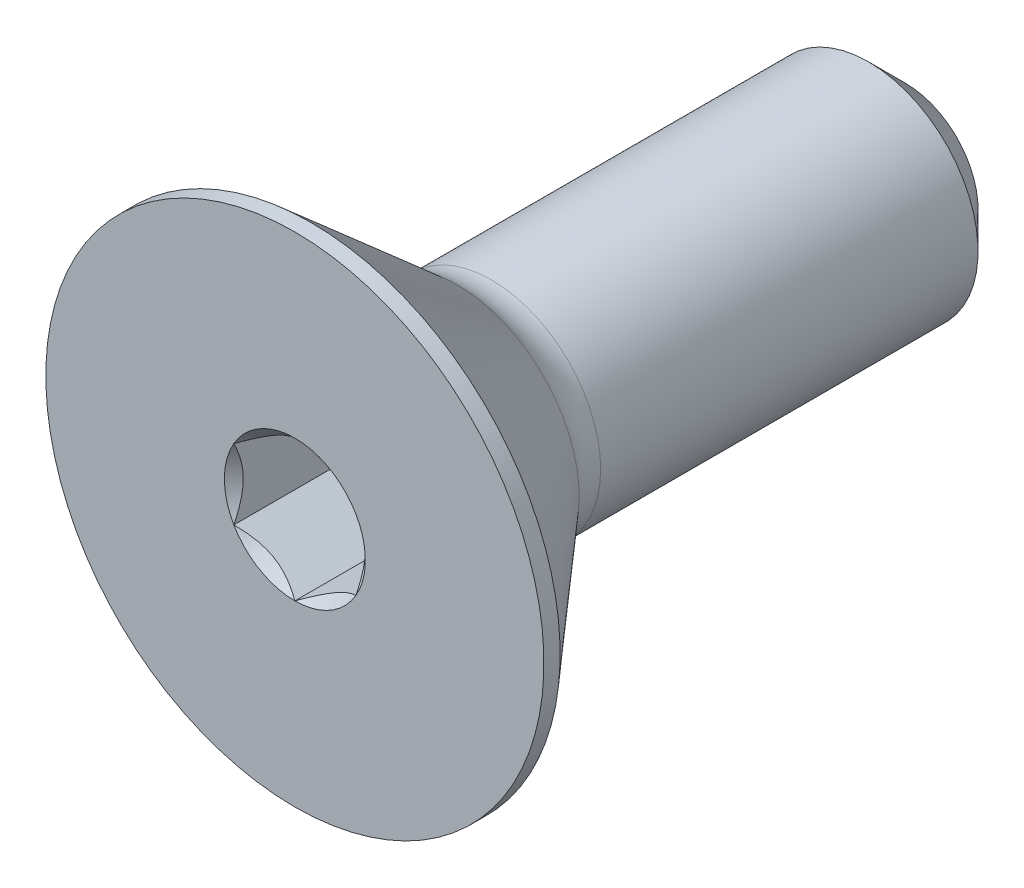
ISO-10303-21;
HEADER;
FILE_DESCRIPTION(('STEP AP214'),'2;1');
FILE_NAME('part.step','',(''),(''),'','','');
FILE_SCHEMA(('AUTOMOTIVE_DESIGN { 1 0 10303 214 1 1 1 1 }'));
ENDSEC;
DATA;
#1=APPLICATION_CONTEXT('core data for automotive mechanical design processes');
#2=APPLICATION_PROTOCOL_DEFINITION('international standard','automotive_design',2000,#1);
#3=PRODUCT_CONTEXT('',#1,'mechanical');
#4=PRODUCT('Part','Part','',(#3));
#5=PRODUCT_RELATED_PRODUCT_CATEGORY('part','',(#4));
#6=PRODUCT_DEFINITION_FORMATION('','',#4);
#7=PRODUCT_DEFINITION_CONTEXT('part definition',#1,'design');
#8=PRODUCT_DEFINITION('design','',#6,#7);
#9=PRODUCT_DEFINITION_SHAPE('','',#8);
#10=(LENGTH_UNIT() NAMED_UNIT(*) SI_UNIT(.MILLI.,.METRE.));
#11=(NAMED_UNIT(*) PLANE_ANGLE_UNIT() SI_UNIT($,.RADIAN.));
#12=(NAMED_UNIT(*) SI_UNIT($,.STERADIAN.) SOLID_ANGLE_UNIT());
#13=UNCERTAINTY_MEASURE_WITH_UNIT(LENGTH_MEASURE(1.E-05),#10,'distance_accuracy_value','');
#14=(GEOMETRIC_REPRESENTATION_CONTEXT(3) GLOBAL_UNCERTAINTY_ASSIGNED_CONTEXT((#13)) GLOBAL_UNIT_ASSIGNED_CONTEXT((#10,
#11,#12)) REPRESENTATION_CONTEXT('',''));
#15=CARTESIAN_POINT('',(0.,0.,0.));
#16=DIRECTION('',(0.,0.,1.));
#17=DIRECTION('',(1.,0.,0.));
#18=AXIS2_PLACEMENT_3D('',#15,#16,#17);
#19=CARTESIAN_POINT('',(0.,0.,0.));
#20=DIRECTION('',(0.,0.,-1.));
#21=DIRECTION('',(0.,1.,0.));
#22=AXIS2_PLACEMENT_3D('',#19,#20,#21);
#23=PLANE('',#22);
#24=CARTESIAN_POINT('',(0.,0.,0.));
#25=DIRECTION('',(0.,0.,1.));
#26=DIRECTION('',(1.,0.,0.));
#27=AXIS2_PLACEMENT_3D('',#24,#25,#26);
#28=CIRCLE('',#27,0.916543552338531);
#29=CARTESIAN_POINT('',(0.,0.916543552338531,0.));
#30=VERTEX_POINT('',#29);
#31=CARTESIAN_POINT('',(-0.79375,0.458271776169266,0.));
#32=VERTEX_POINT('',#31);
#33=EDGE_CURVE('E135',#30,#32,#28,.T.);
#34=ORIENTED_EDGE('',*,*,#33,.F.);
#35=CARTESIAN_POINT('',(0.793749999999999,0.458271776169267,0.));
#36=VERTEX_POINT('',#35);
#37=EDGE_CURVE('E132',#36,#30,#28,.T.);
#38=ORIENTED_EDGE('',*,*,#37,.F.);
#39=CARTESIAN_POINT('',(0.79375,-0.458271776169267,0.));
#40=VERTEX_POINT('',#39);
#41=EDGE_CURVE('E103',#40,#36,#28,.T.);
#42=ORIENTED_EDGE('',*,*,#41,.F.);
#43=CARTESIAN_POINT('',(0.,-0.916543552338531,0.));
#44=VERTEX_POINT('',#43);
#45=EDGE_CURVE('E95',#44,#40,#28,.T.);
#46=ORIENTED_EDGE('',*,*,#45,.F.);
#47=CARTESIAN_POINT('',(-0.79375,-0.458271776169265,0.));
#48=VERTEX_POINT('',#47);
#49=EDGE_CURVE('E56',#48,#44,#28,.T.);
#50=ORIENTED_EDGE('',*,*,#49,.F.);
#51=EDGE_CURVE('E63',#32,#48,#28,.T.);
#52=ORIENTED_EDGE('',*,*,#51,.F.);
#53=EDGE_LOOP('',(#34,#38,#42,#46,#50,#52));
#54=FACE_BOUND('',#53,.T.);
#55=CARTESIAN_POINT('',(0.,0.,0.));
#56=DIRECTION('',(0.,0.,1.));
#57=DIRECTION('',(0.,-1.,0.));
#58=AXIS2_PLACEMENT_3D('',#55,#56,#57);
#59=CIRCLE('',#58,3.2385);
#60=CARTESIAN_POINT('',(0.,-3.2385,0.));
#61=VERTEX_POINT('',#60);
#62=EDGE_CURVE('E177',#61,#61,#59,.T.);
#63=ORIENTED_EDGE('',*,*,#62,.T.);
#64=EDGE_LOOP('',(#63));
#65=FACE_BOUND('',#64,.T.);
#66=ADVANCED_FACE('F37',(#54,#65),#23,.F.);
#67=CARTESIAN_POINT('',(0.,0.,-2.55414694180031));
#68=DIRECTION('',(0.,0.,1.));
#69=DIRECTION('',(0.,-1.,0.));
#70=AXIS2_PLACEMENT_3D('',#67,#68,#69);
#71=TOROIDAL_SURFACE('',#70,2.10213600254615,0.679736002546144);
#72=CARTESIAN_POINT('',(0.,0.,-2.1082));
#73=DIRECTION('',(0.,0.,1.));
#74=DIRECTION('',(0.,-1.,0.));
#75=AXIS2_PLACEMENT_3D('',#72,#73,#74);
#76=CIRCLE('',#75,1.58913272940224);
#77=CARTESIAN_POINT('',(0.,-1.58913272940224,-2.1082));
#78=VERTEX_POINT('',#77);
#79=EDGE_CURVE('E50',#78,#78,#76,.T.);
#80=ORIENTED_EDGE('',*,*,#79,.F.);
#81=EDGE_LOOP('',(#80));
#82=FACE_BOUND('',#81,.T.);
#83=CARTESIAN_POINT('',(0.,0.,-2.55414694180031));
#84=DIRECTION('',(0.,0.,1.));
#85=DIRECTION('',(1.,0.,0.));
#86=AXIS2_PLACEMENT_3D('',#83,#84,#85);
#87=CIRCLE('',#86,1.4224);
#88=CARTESIAN_POINT('',(1.4224,0.,-2.55414694180031));
#89=VERTEX_POINT('',#88);
#90=EDGE_CURVE('E174',#89,#89,#87,.F.);
#91=ORIENTED_EDGE('',*,*,#90,.F.);
#92=EDGE_LOOP('',(#91));
#93=FACE_BOUND('',#92,.T.);
#94=ADVANCED_FACE('F187',(#82,#93),#71,.F.);
#95=CARTESIAN_POINT('',(0.,0.,-2.1082));
#96=DIRECTION('',(0.,0.,1.));
#97=DIRECTION('',(0.,-1.,0.));
#98=AXIS2_PLACEMENT_3D('',#95,#96,#97);
#99=CONICAL_SURFACE('',#98,1.58913272940224,0.715584993317676);
#100=CARTESIAN_POINT('',(0.,0.,-0.210819999999999));
#101=DIRECTION('',(0.,0.,1.));
#102=DIRECTION('',(0.,-1.,0.));
#103=AXIS2_PLACEMENT_3D('',#100,#101,#102);
#104=CIRCLE('',#103,3.2385);
#105=CARTESIAN_POINT('',(0.,-3.2385,-0.210819999999998));
#106=VERTEX_POINT('',#105);
#107=EDGE_CURVE('E180',#106,#106,#104,.T.);
#108=ORIENTED_EDGE('',*,*,#107,.F.);
#109=EDGE_LOOP('',(#108));
#110=FACE_BOUND('',#109,.T.);
#111=ORIENTED_EDGE('',*,*,#79,.T.);
#112=EDGE_LOOP('',(#111));
#113=FACE_BOUND('',#112,.T.);
#114=ADVANCED_FACE('F185',(#110,#113),#99,.T.);
#115=CARTESIAN_POINT('',(0.,0.,0.));
#116=DIRECTION('',(0.,0.,1.));
#117=DIRECTION('',(0.,-1.,0.));
#118=AXIS2_PLACEMENT_3D('',#115,#116,#117);
#119=CYLINDRICAL_SURFACE('',#118,3.2385);
#120=ORIENTED_EDGE('',*,*,#62,.F.);
#121=EDGE_LOOP('',(#120));
#122=FACE_BOUND('',#121,.T.);
#123=ORIENTED_EDGE('',*,*,#107,.T.);
#124=EDGE_LOOP('',(#123));
#125=FACE_BOUND('',#124,.T.);
#126=ADVANCED_FACE('F206',(#122,#125),#119,.T.);
#127=CARTESIAN_POINT('',(0.,-1.4224,-7.9375));
#128=DIRECTION('',(0.,0.,-1.));
#129=DIRECTION('',(0.,1.,0.));
#130=AXIS2_PLACEMENT_3D('',#127,#128,#129);
#131=PLANE('',#130);
#132=CARTESIAN_POINT('',(0.,0.,-7.9375));
#133=DIRECTION('',(0.,0.,-1.));
#134=DIRECTION('',(0.,1.,0.));
#135=AXIS2_PLACEMENT_3D('',#132,#133,#134);
#136=CIRCLE('',#135,0.94615);
#137=CARTESIAN_POINT('',(0.,0.946149999999999,-7.9375));
#138=VERTEX_POINT('',#137);
#139=EDGE_CURVE('E168',#138,#138,#136,.T.);
#140=ORIENTED_EDGE('',*,*,#139,.T.);
#141=EDGE_LOOP('',(#140));
#142=FACE_BOUND('',#141,.T.);
#143=ADVANCED_FACE('F196',(#142),#131,.T.);
#144=CARTESIAN_POINT('',(0.,0.,-7.9375));
#145=DIRECTION('',(0.,0.,-1.));
#146=DIRECTION('',(0.,1.,0.));
#147=AXIS2_PLACEMENT_3D('',#144,#145,#146);
#148=CYLINDRICAL_SURFACE('',#147,1.4224);
#149=ORIENTED_EDGE('',*,*,#90,.T.);
#150=EDGE_LOOP('',(#149));
#151=FACE_BOUND('',#150,.T.);
#152=CARTESIAN_POINT('',(0.,0.,-7.46125));
#153=DIRECTION('',(0.,0.,-1.));
#154=DIRECTION('',(0.,1.,0.));
#155=AXIS2_PLACEMENT_3D('',#152,#153,#154);
#156=CIRCLE('',#155,1.4224);
#157=CARTESIAN_POINT('',(0.,1.4224,-7.46125));
#158=VERTEX_POINT('',#157);
#159=EDGE_CURVE('E171',#158,#158,#156,.F.);
#160=ORIENTED_EDGE('',*,*,#159,.T.);
#161=EDGE_LOOP('',(#160));
#162=FACE_BOUND('',#161,.T.);
#163=ADVANCED_FACE('F192',(#151,#162),#148,.T.);
#164=CARTESIAN_POINT('',(0.,0.,-7.9375));
#165=DIRECTION('',(0.,0.,1.));
#166=DIRECTION('',(0.,-1.,0.));
#167=AXIS2_PLACEMENT_3D('',#164,#165,#166);
#168=CONICAL_SURFACE('',#167,0.94615,0.785398163397447);
#169=ORIENTED_EDGE('',*,*,#159,.F.);
#170=EDGE_LOOP('',(#169));
#171=FACE_BOUND('',#170,.T.);
#172=ORIENTED_EDGE('',*,*,#139,.F.);
#173=EDGE_LOOP('',(#172));
#174=FACE_BOUND('',#173,.T.);
#175=ADVANCED_FACE('F195',(#171,#174),#168,.T.);
#176=CARTESIAN_POINT('',(0.,0.,0.));
#177=DIRECTION('',(0.,0.,1.));
#178=DIRECTION('',(1.,0.,0.));
#179=AXIS2_PLACEMENT_3D('',#176,#177,#178);
#180=CONICAL_SURFACE('',#179,0.916543552338531,0.78539816339745);
#181=ORIENTED_EDGE('',*,*,#41,.T.);
#182=CARTESIAN_POINT('',(0.79375,-0.91398096876427,0.29399363162703));
#183=CARTESIAN_POINT('',(0.79375,-0.891726118538058,0.277193311496454));
#184=CARTESIAN_POINT('',(0.79375,-0.869347264877754,0.260557718257383));
#185=CARTESIAN_POINT('',(0.79375,-0.824291243045381,0.227684030234419));
#186=CARTESIAN_POINT('',(0.79375,-0.801614001904389,0.211446035566629));
#187=CARTESIAN_POINT('',(0.79375,-0.732727209979179,0.163198806065011));
#188=CARTESIAN_POINT('',(0.79375,-0.686000956762753,0.131915081801585));
#189=CARTESIAN_POINT('',(0.79375,-0.588017825073376,0.0705014022532249));
#190=CARTESIAN_POINT('',(0.79375,-0.536654577597367,0.0405392248282665));
#191=CARTESIAN_POINT('',(0.79375,-0.431362595405615,-0.0142679836015014));
#192=CARTESIAN_POINT('',(0.79375,-0.37744329516055,-0.0391302653555219));
#193=CARTESIAN_POINT('',(0.79375,-0.296509956256361,-0.0695469630115003));
#194=CARTESIAN_POINT('',(0.79375,-0.270694141900048,-0.0782767741549617));
#195=CARTESIAN_POINT('',(0.79375,-0.218439268973957,-0.0936638158775348));
#196=CARTESIAN_POINT('',(0.793749999999999,-0.192000167603285,-0.100320903674907));
#197=CARTESIAN_POINT('',(0.793749999999999,-0.139102716934156,-0.111104981160201));
#198=CARTESIAN_POINT('',(0.793749999999999,-0.1126534206794,-0.115275685244174));
#199=CARTESIAN_POINT('',(0.793749999999999,-0.0594633329666483,-0.121008229605796));
#200=CARTESIAN_POINT('',(0.793749999999999,-0.0327224976765041,-0.122569671987745));
#201=CARTESIAN_POINT('',(0.793749999999999,0.0198050550771906,-0.122965171893323));
#202=CARTESIAN_POINT('',(0.793749999999999,0.0455910742996338,-0.121896431038319));
#203=CARTESIAN_POINT('',(0.793749999999999,0.0969445862525447,-0.117304647495368));
#204=CARTESIAN_POINT('',(0.793749999999999,0.122512036164617,-0.113781134579864));
#205=CARTESIAN_POINT('',(0.793749999999999,0.173672423354302,-0.104412391955401));
#206=CARTESIAN_POINT('',(0.793749999999999,0.199258034653237,-0.0985277583090954));
#207=CARTESIAN_POINT('',(0.793749999999999,0.24987022269789,-0.0847495266810377));
#208=CARTESIAN_POINT('',(0.793749999999999,0.274896846029654,-0.0768560967969812));
#209=CARTESIAN_POINT('',(0.793749999999999,0.353690387196625,-0.0490351109532753));
#210=CARTESIAN_POINT('',(0.793749999999999,0.406335817043668,-0.0259390687874103));
#211=CARTESIAN_POINT('',(0.793749999999999,0.509153512571149,0.0254121679018167));
#212=CARTESIAN_POINT('',(0.793749999999999,0.55931604293687,0.0536858976787275));
#213=CARTESIAN_POINT('',(0.793749999999999,0.655183863923377,0.112017096551378));
#214=CARTESIAN_POINT('',(0.793749999999999,0.700986777162505,0.141916107892191));
#215=CARTESIAN_POINT('',(0.793749999999999,0.768468152386359,0.188136889360362));
#216=CARTESIAN_POINT('',(0.793749999999999,0.790670702494179,0.203706789966172));
#217=CARTESIAN_POINT('',(0.793749999999999,0.834772410478894,0.235258385232155));
#218=CARTESIAN_POINT('',(0.793749999999999,0.856671649663553,0.251239966115281));
#219=CARTESIAN_POINT('',(0.793749999999999,0.878444595919576,0.267392244316129));
#220=B_SPLINE_CURVE_WITH_KNOTS('',3,(#182,#183,#184,#185,#186,#187,#188,#189,#190,#191,#192,
#193,#194,#195,#196,#197,#198,#199,#200,#201,#202,#203,#204,#205,#206,#207,#208,#209,#210,#211,
#212,#213,#214,#215,#216,#217,#218,#219),.UNSPECIFIED.,.F.,.F.,(4,2,2,2,2,2,2,2,2,2,2,2,2,2,2,2,
2,2,4),(0.,0.0836505019132843,0.167321854975135,0.335941679244389,0.514186123196811,
0.691817321841751,0.773503877759007,0.855196059496705,0.935406023972401,1.01562821883824,
1.09293052036568,1.17024763372476,1.24891262607845,1.32757103784517,1.49953149859789,
1.67212003005564,1.83613214173928,1.91748242813391,1.99881046779771),.UNSPECIFIED.);
#221=EDGE_CURVE('E11',#40,#36,#220,.T.);
#222=ORIENTED_EDGE('',*,*,#221,.F.);
#223=EDGE_LOOP('',(#181,#222));
#224=FACE_BOUND('',#223,.T.);
#225=ADVANCED_FACE('F107',(#224),#180,.F.);
#226=ORIENTED_EDGE('',*,*,#37,.T.);
#227=CARTESIAN_POINT('',(0.793949999999999,0.458156306115428,0.000115491872200822));
#228=CARTESIAN_POINT('',(0.7666563268291,0.473914315667821,-0.0156332211800427));
#229=CARTESIAN_POINT('',(0.738906237701708,0.489935837095556,-0.0304574524158222));
#230=CARTESIAN_POINT('',(0.68232025046316,0.522605772060093,-0.0576009622140627));
#231=CARTESIAN_POINT('',(0.653478963353311,0.539257296936739,-0.0699051262716217));
#232=CARTESIAN_POINT('',(0.595321679020445,0.572834420701658,-0.0909826334294043));
#233=CARTESIAN_POINT('',(0.56602051479722,0.589751455753506,-0.0998089918524528));
#234=CARTESIAN_POINT('',(0.506773157113023,0.623957933661251,-0.113408761275762));
#235=CARTESIAN_POINT('',(0.476828775638362,0.641246330366363,-0.118192331870018));
#236=CARTESIAN_POINT('',(0.425225377533547,0.671039566153277,-0.122506590544054));
#237=CARTESIAN_POINT('',(0.403633531741488,0.683505624133624,-0.123144728589032));
#238=CARTESIAN_POINT('',(0.360491632722968,0.708413611145318,-0.122073860208805));
#239=CARTESIAN_POINT('',(0.338941589763515,0.720855534249006,-0.12036433611821));
#240=CARTESIAN_POINT('',(0.274599154455217,0.758003656594568,-0.111827208841405));
#241=CARTESIAN_POINT('',(0.232126946019304,0.78252499756812,-0.101590080863207));
#242=CARTESIAN_POINT('',(0.157575609219718,0.825567231937808,-0.0768814101594512));
#243=CARTESIAN_POINT('',(0.125147212182332,0.84428977569673,-0.0637038253246891));
#244=CARTESIAN_POINT('',(0.0615608535385162,0.881001376976526,-0.0340189600483212));
#245=CARTESIAN_POINT('',(0.0303991453684828,0.898992597576903,-0.0175225121068321));
#246=CARTESIAN_POINT('',(-0.000200000000000081,0.916659022392369,0.000115491872201479));
#247=B_SPLINE_CURVE_WITH_KNOTS('',3,(#227,#228,#229,#230,#231,#232,#233,#234,#235,#236,#237,
#238,#239,#240,#241,#242,#243,#244,#245,#246),.UNSPECIFIED.,.F.,.F.,(4,2,2,2,2,2,2,2,2,4),(0.,
0.105768699105621,0.212154297186219,0.316848842533858,0.421279499712345,0.495991864977073,
0.570720707151283,0.720221070373883,0.839150369964801,0.95769761411839),.UNSPECIFIED.);
#248=EDGE_CURVE('E134',#36,#30,#247,.T.);
#249=ORIENTED_EDGE('',*,*,#248,.F.);
#250=EDGE_LOOP('',(#226,#249));
#251=FACE_BOUND('',#250,.T.);
#252=ADVANCED_FACE('F318',(#251),#180,.F.);
#253=ORIENTED_EDGE('',*,*,#33,.T.);
#254=CARTESIAN_POINT('',(0.000199999999999999,0.916659022392369,0.00011549187220145));
#255=CARTESIAN_POINT('',(-0.0270936731708998,0.900901012839977,-0.0156332211800419));
#256=CARTESIAN_POINT('',(-0.0548437622982911,0.884879491412241,-0.0304574524158216));
#257=CARTESIAN_POINT('',(-0.11142974953684,0.852209556447704,-0.0576009622140623));
#258=CARTESIAN_POINT('',(-0.140271036646688,0.835558031571058,-0.0699051262716214));
#259=CARTESIAN_POINT('',(-0.198428320979555,0.80198090780614,-0.090982633429404));
#260=CARTESIAN_POINT('',(-0.22772948520278,0.785063872754291,-0.0998089918524526));
#261=CARTESIAN_POINT('',(-0.286976842886977,0.750857394846547,-0.113408761275762));
#262=CARTESIAN_POINT('',(-0.316921224361638,0.733568998141434,-0.118192331870018));
#263=CARTESIAN_POINT('',(-0.368524622466452,0.70377576235452,-0.122506590544054));
#264=CARTESIAN_POINT('',(-0.390116468258512,0.691309704374173,-0.123144728589032));
#265=CARTESIAN_POINT('',(-0.433258367277032,0.666401717362479,-0.122073860208805));
#266=CARTESIAN_POINT('',(-0.454808410236485,0.653959794258791,-0.12036433611821));
#267=CARTESIAN_POINT('',(-0.519150845544783,0.616811671913229,-0.111827208841405));
#268=CARTESIAN_POINT('',(-0.561623053980695,0.592290330939677,-0.101590080863207));
#269=CARTESIAN_POINT('',(-0.636174390780282,0.54924809656999,-0.0768814101594512));
#270=CARTESIAN_POINT('',(-0.668602787817667,0.530525552811067,-0.0637038253246891));
#271=CARTESIAN_POINT('',(-0.732189146461484,0.493813951531271,-0.0340189600483211));
#272=CARTESIAN_POINT('',(-0.763350854631517,0.475822730930894,-0.0175225121068321));
#273=CARTESIAN_POINT('',(-0.79395,0.458156306115428,0.000115491872201465));
#274=B_SPLINE_CURVE_WITH_KNOTS('',3,(#254,#255,#256,#257,#258,#259,#260,#261,#262,#263,#264,
#265,#266,#267,#268,#269,#270,#271,#272,#273),.UNSPECIFIED.,.F.,.F.,(4,2,2,2,2,2,2,2,2,4),(0.,
0.105768699105621,0.21215429718622,0.316848842533859,0.421279499712346,0.495991864977074,
0.570720707151283,0.720221070373884,0.839150369964802,0.957697614118391),.UNSPECIFIED.);
#275=EDGE_CURVE('E138',#30,#32,#274,.T.);
#276=ORIENTED_EDGE('',*,*,#275,.F.);
#277=EDGE_LOOP('',(#253,#276));
#278=FACE_BOUND('',#277,.T.);
#279=ADVANCED_FACE('F141',(#278),#180,.F.);
#280=ORIENTED_EDGE('',*,*,#51,.T.);
#281=CARTESIAN_POINT('',(-0.79375,-0.913980968764268,0.293993631627029));
#282=CARTESIAN_POINT('',(-0.79375,-0.891726118538057,0.277193311496454));
#283=CARTESIAN_POINT('',(-0.79375,-0.869347264877753,0.260557718257382));
#284=CARTESIAN_POINT('',(-0.79375,-0.824291243045379,0.227684030234418));
#285=CARTESIAN_POINT('',(-0.79375,-0.801614001904387,0.211446035566629));
#286=CARTESIAN_POINT('',(-0.79375,-0.732727209979178,0.16319880606501));
#287=CARTESIAN_POINT('',(-0.79375,-0.686000956762752,0.131915081801585));
#288=CARTESIAN_POINT('',(-0.79375,-0.588017825073375,0.070501402253225));
#289=CARTESIAN_POINT('',(-0.79375,-0.536654577597367,0.0405392248282667));
#290=CARTESIAN_POINT('',(-0.79375,-0.431362595405615,-0.0142679836015009));
#291=CARTESIAN_POINT('',(-0.79375,-0.377443295160549,-0.0391302653555213));
#292=CARTESIAN_POINT('',(-0.79375,-0.296509956256361,-0.0695469630114997));
#293=CARTESIAN_POINT('',(-0.79375,-0.270694141900047,-0.0782767741549612));
#294=CARTESIAN_POINT('',(-0.79375,-0.218439268973956,-0.0936638158775342));
#295=CARTESIAN_POINT('',(-0.79375,-0.192000167603285,-0.100320903674907));
#296=CARTESIAN_POINT('',(-0.79375,-0.139102716934156,-0.111104981160201));
#297=CARTESIAN_POINT('',(-0.79375,-0.112653420679399,-0.115275685244173));
#298=CARTESIAN_POINT('',(-0.79375,-0.0594633329666477,-0.121008229605795));
#299=CARTESIAN_POINT('',(-0.79375,-0.0327224976765034,-0.122569671987744));
#300=CARTESIAN_POINT('',(-0.79375,0.0198050550771913,-0.122965171893322));
#301=CARTESIAN_POINT('',(-0.79375,0.0455910742996346,-0.121896431038319));
#302=CARTESIAN_POINT('',(-0.79375,0.0969445862525453,-0.117304647495367));
#303=CARTESIAN_POINT('',(-0.79375,0.122512036164618,-0.113781134579863));
#304=CARTESIAN_POINT('',(-0.79375,0.173672423354303,-0.1044123919554));
#305=CARTESIAN_POINT('',(-0.79375,0.199258034653238,-0.0985277583090944));
#306=CARTESIAN_POINT('',(-0.79375,0.249870222697891,-0.0847495266810366));
#307=CARTESIAN_POINT('',(-0.79375,0.274896846029655,-0.0768560967969802));
#308=CARTESIAN_POINT('',(-0.79375,0.353690387196626,-0.0490351109532742));
#309=CARTESIAN_POINT('',(-0.79375,0.406335817043669,-0.0259390687874091));
#310=CARTESIAN_POINT('',(-0.79375,0.509153512571151,0.0254121679018181));
#311=CARTESIAN_POINT('',(-0.79375,0.559316042936872,0.053685897678729));
#312=CARTESIAN_POINT('',(-0.79375,0.655183863923379,0.11201709655138));
#313=CARTESIAN_POINT('',(-0.79375,0.700986777162507,0.141916107892193));
#314=CARTESIAN_POINT('',(-0.79375,0.768468152386361,0.188136889360364));
#315=CARTESIAN_POINT('',(-0.79375,0.790670702494182,0.203706789966174));
#316=CARTESIAN_POINT('',(-0.79375,0.834772410478896,0.235258385232157));
#317=CARTESIAN_POINT('',(-0.79375,0.856671649663555,0.251239966115283));
#318=CARTESIAN_POINT('',(-0.79375,0.878444595919579,0.267392244316131));
#319=B_SPLINE_CURVE_WITH_KNOTS('',3,(#281,#282,#283,#284,#285,#286,#287,#288,#289,#290,#291,
#292,#293,#294,#295,#296,#297,#298,#299,#300,#301,#302,#303,#304,#305,#306,#307,#308,#309,#310,
#311,#312,#313,#314,#315,#316,#317,#318),.UNSPECIFIED.,.F.,.F.,(4,2,2,2,2,2,2,2,2,2,2,2,2,2,2,2,
2,2,4),(0.,0.0836505019132839,0.167321854975135,0.335941679244387,0.514186123196809,
0.691817321841749,0.773503877759005,0.855196059496703,0.935406023972399,1.01562821883824,
1.09293052036567,1.17024763372476,1.24891262607845,1.32757103784517,1.49953149859788,
1.67212003005564,1.83613214173928,1.91748242813391,1.99881046779772),.UNSPECIFIED.);
#320=EDGE_CURVE('E144',#32,#48,#319,.F.);
#321=ORIENTED_EDGE('',*,*,#320,.F.);
#322=EDGE_LOOP('',(#280,#321));
#323=FACE_BOUND('',#322,.T.);
#324=ADVANCED_FACE('F145',(#323),#180,.F.);
#325=ORIENTED_EDGE('',*,*,#49,.T.);
#326=CARTESIAN_POINT('',(-0.79395,-0.458156306115428,0.000115491872201364));
#327=CARTESIAN_POINT('',(-0.766656326829101,-0.47391431566782,-0.0156332211800422));
#328=CARTESIAN_POINT('',(-0.738906237701709,-0.489935837095556,-0.0304574524158219));
#329=CARTESIAN_POINT('',(-0.68232025046316,-0.522605772060093,-0.0576009622140625));
#330=CARTESIAN_POINT('',(-0.653478963353312,-0.539257296936739,-0.0699051262716215));
#331=CARTESIAN_POINT('',(-0.595321679020445,-0.572834420701657,-0.0909826334294042));
#332=CARTESIAN_POINT('',(-0.56602051479722,-0.589751455753506,-0.0998089918524528));
#333=CARTESIAN_POINT('',(-0.506773157113024,-0.62395793366125,-0.113408761275762));
#334=CARTESIAN_POINT('',(-0.476828775638363,-0.641246330366363,-0.118192331870017));
#335=CARTESIAN_POINT('',(-0.425225377533548,-0.671039566153277,-0.122506590544054));
#336=CARTESIAN_POINT('',(-0.403633531741489,-0.683505624133623,-0.123144728589032));
#337=CARTESIAN_POINT('',(-0.360491632722968,-0.708413611145318,-0.122073860208806));
#338=CARTESIAN_POINT('',(-0.338941589763515,-0.720855534249006,-0.12036433611821));
#339=CARTESIAN_POINT('',(-0.274599154455217,-0.758003656594568,-0.111827208841405));
#340=CARTESIAN_POINT('',(-0.232126946019305,-0.78252499756812,-0.101590080863207));
#341=CARTESIAN_POINT('',(-0.157575609219719,-0.825567231937808,-0.0768814101594513));
#342=CARTESIAN_POINT('',(-0.125147212182333,-0.84428977569673,-0.0637038253246892));
#343=CARTESIAN_POINT('',(-0.0615608535385167,-0.881001376976526,-0.0340189600483213));
#344=CARTESIAN_POINT('',(-0.0303991453684833,-0.898992597576903,-0.0175225121068323));
#345=CARTESIAN_POINT('',(0.000199999999999594,-0.916659022392369,0.00011549187220126));
#346=B_SPLINE_CURVE_WITH_KNOTS('',3,(#326,#327,#328,#329,#330,#331,#332,#333,#334,#335,#336,
#337,#338,#339,#340,#341,#342,#343,#344,#345),.UNSPECIFIED.,.F.,.F.,(4,2,2,2,2,2,2,2,2,4),(0.,
0.105768699105621,0.21215429718622,0.316848842533859,0.421279499712346,0.495991864977074,
0.570720707151284,0.720221070373884,0.839150369964802,0.957697614118391),.UNSPECIFIED.);
#347=EDGE_CURVE('E119',#48,#44,#346,.T.);
#348=ORIENTED_EDGE('',*,*,#347,.F.);
#349=EDGE_LOOP('',(#325,#348));
#350=FACE_BOUND('',#349,.T.);
#351=ADVANCED_FACE('F337',(#350),#180,.F.);
#352=ORIENTED_EDGE('',*,*,#45,.T.);
#353=CARTESIAN_POINT('',(-0.000200000000000402,-0.916659022392369,0.000115491872201234));
#354=CARTESIAN_POINT('',(0.0270936731708995,-0.900901012839976,-0.0156332211800422));
#355=CARTESIAN_POINT('',(0.0548437622982909,-0.884879491412241,-0.0304574524158219));
#356=CARTESIAN_POINT('',(0.11142974953684,-0.852209556447704,-0.0576009622140626));
#357=CARTESIAN_POINT('',(0.140271036646688,-0.835558031571058,-0.0699051262716217));
#358=CARTESIAN_POINT('',(0.198428320979555,-0.80198090780614,-0.0909826334294043));
#359=CARTESIAN_POINT('',(0.22772948520278,-0.785063872754291,-0.0998089918524528));
#360=CARTESIAN_POINT('',(0.286976842886976,-0.750857394846546,-0.113408761275762));
#361=CARTESIAN_POINT('',(0.316921224361637,-0.733568998141434,-0.118192331870018));
#362=CARTESIAN_POINT('',(0.368524622466452,-0.70377576235452,-0.122506590544054));
#363=CARTESIAN_POINT('',(0.390116468258511,-0.691309704374173,-0.123144728589032));
#364=CARTESIAN_POINT('',(0.433258367277031,-0.666401717362479,-0.122073860208806));
#365=CARTESIAN_POINT('',(0.454808410236485,-0.653959794258791,-0.12036433611821));
#366=CARTESIAN_POINT('',(0.519150845544783,-0.616811671913229,-0.111827208841406));
#367=CARTESIAN_POINT('',(0.561623053980695,-0.592290330939677,-0.101590080863207));
#368=CARTESIAN_POINT('',(0.636174390780281,-0.54924809656999,-0.0768814101594515));
#369=CARTESIAN_POINT('',(0.668602787817667,-0.530525552811067,-0.0637038253246895));
#370=CARTESIAN_POINT('',(0.732189146461483,-0.493813951531272,-0.0340189600483216));
#371=CARTESIAN_POINT('',(0.763350854631517,-0.475822730930894,-0.0175225121068326));
#372=CARTESIAN_POINT('',(0.793949999999999,-0.458156306115428,0.000115491872200936));
#373=B_SPLINE_CURVE_WITH_KNOTS('',3,(#353,#354,#355,#356,#357,#358,#359,#360,#361,#362,#363,
#364,#365,#366,#367,#368,#369,#370,#371,#372),.UNSPECIFIED.,.F.,.F.,(4,2,2,2,2,2,2,2,2,4),(0.,
0.105768699105622,0.21215429718622,0.316848842533859,0.421279499712346,0.495991864977074,
0.570720707151283,0.720221070373884,0.839150369964801,0.957697614118391),.UNSPECIFIED.);
#374=EDGE_CURVE('E99',#44,#40,#373,.T.);
#375=ORIENTED_EDGE('',*,*,#374,.F.);
#376=EDGE_LOOP('',(#352,#375));
#377=FACE_BOUND('',#376,.T.);
#378=ADVANCED_FACE('F97',(#377),#180,.F.);
#379=CARTESIAN_POINT('',(0.79375,-0.458271776169266,-1.47574));
#380=DIRECTION('',(0.,0.,1.));
#381=DIRECTION('',(1.,0.,0.));
#382=AXIS2_PLACEMENT_3D('',#379,#380,#381);
#383=PLANE('',#382);
#384=DIRECTION('',(0.866025403784439,0.5,0.));
#385=VECTOR('',#384,1.);
#386=CARTESIAN_POINT('',(0.,-0.916543552338531,-1.47574));
#387=LINE('',#386,#385);
#388=CARTESIAN_POINT('',(0.,-0.916543552338531,-1.47574));
#389=VERTEX_POINT('',#388);
#390=CARTESIAN_POINT('',(0.79375,-0.458271776169266,-1.47574));
#391=VERTEX_POINT('',#390);
#392=EDGE_CURVE('E118',#389,#391,#387,.T.);
#393=ORIENTED_EDGE('',*,*,#392,.T.);
#394=DIRECTION('',(0.,1.,0.));
#395=VECTOR('',#394,1.);
#396=CARTESIAN_POINT('',(0.79375,-0.458271776169266,-1.47574));
#397=LINE('',#396,#395);
#398=CARTESIAN_POINT('',(0.793749999999999,0.458271776169266,-1.47574));
#399=VERTEX_POINT('',#398);
#400=EDGE_CURVE('E123',#391,#399,#397,.T.);
#401=ORIENTED_EDGE('',*,*,#400,.T.);
#402=DIRECTION('',(-0.866025403784439,0.5,0.));
#403=VECTOR('',#402,1.);
#404=CARTESIAN_POINT('',(0.793749999999999,0.458271776169266,-1.47574));
#405=LINE('',#404,#403);
#406=CARTESIAN_POINT('',(0.,0.916543552338531,-1.47574));
#407=VERTEX_POINT('',#406);
#408=EDGE_CURVE('E400',#399,#407,#405,.T.);
#409=ORIENTED_EDGE('',*,*,#408,.T.);
#410=DIRECTION('',(-0.866025403784439,-0.5,0.));
#411=VECTOR('',#410,1.);
#412=CARTESIAN_POINT('',(0.,0.916543552338531,-1.47574));
#413=LINE('',#412,#411);
#414=CARTESIAN_POINT('',(-0.79375,0.458271776169266,-1.47574));
#415=VERTEX_POINT('',#414);
#416=EDGE_CURVE('E403',#407,#415,#413,.T.);
#417=ORIENTED_EDGE('',*,*,#416,.T.);
#418=DIRECTION('',(0.,-1.,0.));
#419=VECTOR('',#418,1.);
#420=CARTESIAN_POINT('',(-0.79375,0.458271776169266,-1.47574));
#421=LINE('',#420,#419);
#422=CARTESIAN_POINT('',(-0.79375,-0.458271776169266,-1.47574));
#423=VERTEX_POINT('',#422);
#424=EDGE_CURVE('E159',#415,#423,#421,.T.);
#425=ORIENTED_EDGE('',*,*,#424,.T.);
#426=DIRECTION('',(0.866025403784438,-0.5,0.));
#427=VECTOR('',#426,1.);
#428=CARTESIAN_POINT('',(-0.79375,-0.458271776169266,-1.47574));
#429=LINE('',#428,#427);
#430=EDGE_CURVE('E126',#423,#389,#429,.T.);
#431=ORIENTED_EDGE('',*,*,#430,.T.);
#432=EDGE_LOOP('',(#393,#401,#409,#417,#425,#431));
#433=FACE_BOUND('',#432,.T.);
#434=ADVANCED_FACE('F304',(#433),#383,.T.);
#435=CARTESIAN_POINT('',(0.79375,-0.458271776169266,-1.47574));
#436=DIRECTION('',(1.,0.,0.));
#437=DIRECTION('',(0.,1.,0.));
#438=AXIS2_PLACEMENT_3D('',#435,#436,#437);
#439=PLANE('',#438);
#440=DIRECTION('',(0.,0.,1.));
#441=VECTOR('',#440,1.);
#442=CARTESIAN_POINT('',(0.79375,-0.458271776169266,-1.47574));
#443=LINE('',#442,#441);
#444=EDGE_CURVE('E115',#391,#40,#443,.T.);
#445=ORIENTED_EDGE('',*,*,#444,.T.);
#446=ORIENTED_EDGE('',*,*,#221,.T.);
#447=DIRECTION('',(0.,0.,1.));
#448=VECTOR('',#447,1.);
#449=CARTESIAN_POINT('',(0.793749999999999,0.458271776169266,-1.47574));
#450=LINE('',#449,#448);
#451=EDGE_CURVE('E125',#399,#36,#450,.T.);
#452=ORIENTED_EDGE('',*,*,#451,.F.);
#453=ORIENTED_EDGE('',*,*,#400,.F.);
#454=EDGE_LOOP('',(#445,#446,#452,#453));
#455=FACE_BOUND('',#454,.T.);
#456=ADVANCED_FACE('F121',(#455),#439,.F.);
#457=CARTESIAN_POINT('',(0.793749999999999,0.458271776169266,-1.47574));
#458=DIRECTION('',(0.5,0.866025403784439,0.));
#459=DIRECTION('',(-0.866025403784439,0.5,0.));
#460=AXIS2_PLACEMENT_3D('',#457,#458,#459);
#461=PLANE('',#460);
#462=ORIENTED_EDGE('',*,*,#451,.T.);
#463=ORIENTED_EDGE('',*,*,#248,.T.);
#464=DIRECTION('',(0.,0.,1.));
#465=VECTOR('',#464,1.);
#466=CARTESIAN_POINT('',(0.,0.916543552338531,-1.47574));
#467=LINE('',#466,#465);
#468=EDGE_CURVE('E155',#407,#30,#467,.T.);
#469=ORIENTED_EDGE('',*,*,#468,.F.);
#470=ORIENTED_EDGE('',*,*,#408,.F.);
#471=EDGE_LOOP('',(#462,#463,#469,#470));
#472=FACE_BOUND('',#471,.T.);
#473=ADVANCED_FACE('F288',(#472),#461,.F.);
#474=CARTESIAN_POINT('',(0.,0.916543552338531,-1.47574));
#475=DIRECTION('',(-0.5,0.866025403784439,0.));
#476=DIRECTION('',(-0.866025403784439,-0.5,0.));
#477=AXIS2_PLACEMENT_3D('',#474,#475,#476);
#478=PLANE('',#477);
#479=ORIENTED_EDGE('',*,*,#468,.T.);
#480=ORIENTED_EDGE('',*,*,#275,.T.);
#481=DIRECTION('',(0.,0.,1.));
#482=VECTOR('',#481,1.);
#483=CARTESIAN_POINT('',(-0.79375,0.458271776169266,-1.47574));
#484=LINE('',#483,#482);
#485=EDGE_CURVE('E153',#415,#32,#484,.T.);
#486=ORIENTED_EDGE('',*,*,#485,.F.);
#487=ORIENTED_EDGE('',*,*,#416,.F.);
#488=EDGE_LOOP('',(#479,#480,#486,#487));
#489=FACE_BOUND('',#488,.T.);
#490=ADVANCED_FACE('F151',(#489),#478,.F.);
#491=CARTESIAN_POINT('',(-0.79375,0.458271776169266,-1.47574));
#492=DIRECTION('',(-1.,0.,0.));
#493=DIRECTION('',(0.,-1.,0.));
#494=AXIS2_PLACEMENT_3D('',#491,#492,#493);
#495=PLANE('',#494);
#496=ORIENTED_EDGE('',*,*,#485,.T.);
#497=ORIENTED_EDGE('',*,*,#320,.T.);
#498=DIRECTION('',(0.,0.,1.));
#499=VECTOR('',#498,1.);
#500=CARTESIAN_POINT('',(-0.79375,-0.458271776169266,-1.47574));
#501=LINE('',#500,#499);
#502=EDGE_CURVE('E161',#423,#48,#501,.T.);
#503=ORIENTED_EDGE('',*,*,#502,.F.);
#504=ORIENTED_EDGE('',*,*,#424,.F.);
#505=EDGE_LOOP('',(#496,#497,#503,#504));
#506=FACE_BOUND('',#505,.T.);
#507=ADVANCED_FACE('F157',(#506),#495,.F.);
#508=CARTESIAN_POINT('',(-0.79375,-0.458271776169266,-1.47574));
#509=DIRECTION('',(-0.5,-0.866025403784438,0.));
#510=DIRECTION('',(0.866025403784439,-0.5,0.));
#511=AXIS2_PLACEMENT_3D('',#508,#509,#510);
#512=PLANE('',#511);
#513=ORIENTED_EDGE('',*,*,#502,.T.);
#514=ORIENTED_EDGE('',*,*,#347,.T.);
#515=DIRECTION('',(0.,0.,1.));
#516=VECTOR('',#515,1.);
#517=CARTESIAN_POINT('',(0.,-0.916543552338531,-1.47574));
#518=LINE('',#517,#516);
#519=EDGE_CURVE('E117',#389,#44,#518,.T.);
#520=ORIENTED_EDGE('',*,*,#519,.F.);
#521=ORIENTED_EDGE('',*,*,#430,.F.);
#522=EDGE_LOOP('',(#513,#514,#520,#521));
#523=FACE_BOUND('',#522,.T.);
#524=ADVANCED_FACE('F265',(#523),#512,.F.);
#525=CARTESIAN_POINT('',(0.,-0.916543552338531,-1.47574));
#526=DIRECTION('',(0.5,-0.866025403784439,0.));
#527=DIRECTION('',(0.866025403784439,0.5,0.));
#528=AXIS2_PLACEMENT_3D('',#525,#526,#527);
#529=PLANE('',#528);
#530=ORIENTED_EDGE('',*,*,#519,.T.);
#531=ORIENTED_EDGE('',*,*,#374,.T.);
#532=ORIENTED_EDGE('',*,*,#444,.F.);
#533=ORIENTED_EDGE('',*,*,#392,.F.);
#534=EDGE_LOOP('',(#530,#531,#532,#533));
#535=FACE_BOUND('',#534,.T.);
#536=ADVANCED_FACE('F113',(#535),#529,.F.);
#537=CLOSED_SHELL('',(#66,#94,#114,#126,#143,#163,#175,#225,#252,#279,#324,#351,#378,#434,#456,
#473,#490,#507,#524,#536));
#538=MANIFOLD_SOLID_BREP('B2',#537);
#539=ADVANCED_BREP_SHAPE_REPRESENTATION('',(#18,#538),#14);
#540=SHAPE_DEFINITION_REPRESENTATION(#9,#539);
ENDSEC;
END-ISO-10303-21;
